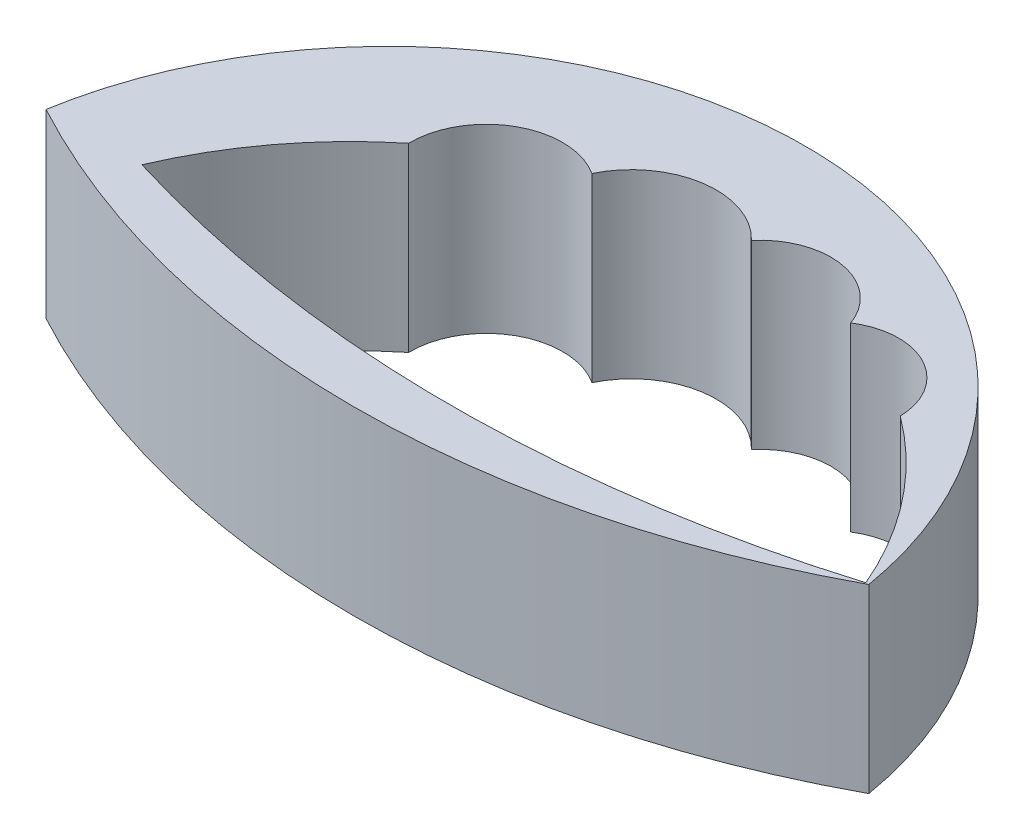
ISO-10303-21;
HEADER;
FILE_DESCRIPTION(('STEP AP214'),'2;1');
FILE_NAME('part.step','',(''),(''),'','','');
FILE_SCHEMA(('AUTOMOTIVE_DESIGN { 1 0 10303 214 1 1 1 1 }'));
ENDSEC;
DATA;
#1=APPLICATION_CONTEXT('core data for automotive mechanical design processes');
#2=APPLICATION_PROTOCOL_DEFINITION('international standard','automotive_design',2000,#1);
#3=PRODUCT_CONTEXT('',#1,'mechanical');
#4=PRODUCT('Part','Part','',(#3));
#5=PRODUCT_RELATED_PRODUCT_CATEGORY('part','',(#4));
#6=PRODUCT_DEFINITION_FORMATION('','',#4);
#7=PRODUCT_DEFINITION_CONTEXT('part definition',#1,'design');
#8=PRODUCT_DEFINITION('design','',#6,#7);
#9=PRODUCT_DEFINITION_SHAPE('','',#8);
#10=(LENGTH_UNIT() NAMED_UNIT(*) SI_UNIT(.MILLI.,.METRE.));
#11=(NAMED_UNIT(*) PLANE_ANGLE_UNIT() SI_UNIT($,.RADIAN.));
#12=(NAMED_UNIT(*) SI_UNIT($,.STERADIAN.) SOLID_ANGLE_UNIT());
#13=UNCERTAINTY_MEASURE_WITH_UNIT(LENGTH_MEASURE(1.E-05),#10,'distance_accuracy_value','');
#14=(GEOMETRIC_REPRESENTATION_CONTEXT(3) GLOBAL_UNCERTAINTY_ASSIGNED_CONTEXT((#13)) GLOBAL_UNIT_ASSIGNED_CONTEXT((#10,
#11,#12)) REPRESENTATION_CONTEXT('',''));
#15=CARTESIAN_POINT('',(0.,0.,0.));
#16=DIRECTION('',(0.,0.,1.));
#17=DIRECTION('',(1.,0.,0.));
#18=AXIS2_PLACEMENT_3D('',#15,#16,#17);
#19=CARTESIAN_POINT('',(27.9373271008039,12.3,-51.9168665411247));
#20=DIRECTION('',(0.,-1.,0.));
#21=DIRECTION('',(0.,0.,-1.));
#22=AXIS2_PLACEMENT_3D('',#19,#20,#21);
#23=CYLINDRICAL_SURFACE('',#22,58.9563845311622);
#24=CARTESIAN_POINT('',(27.9373271008039,0.,-51.9168665411247));
#25=DIRECTION('',(0.,1.,0.));
#26=DIRECTION('',(0.,0.,1.));
#27=AXIS2_PLACEMENT_3D('',#24,#25,#26);
#28=CIRCLE('',#27,58.9563845311622);
#29=CARTESIAN_POINT('',(0.,0.,0.));
#30=VERTEX_POINT('',#29);
#31=CARTESIAN_POINT('',(55.8746542016078,0.,0.));
#32=VERTEX_POINT('',#31);
#33=EDGE_CURVE('E178',#30,#32,#28,.T.);
#34=ORIENTED_EDGE('',*,*,#33,.T.);
#35=DIRECTION('',(0.,-1.,0.));
#36=VECTOR('',#35,1.);
#37=CARTESIAN_POINT('',(55.8746542016078,12.3,0.));
#38=LINE('',#37,#36);
#39=CARTESIAN_POINT('',(55.8746542016078,12.3,0.));
#40=VERTEX_POINT('',#39);
#41=EDGE_CURVE('E11',#40,#32,#38,.T.);
#42=ORIENTED_EDGE('',*,*,#41,.F.);
#43=CARTESIAN_POINT('',(27.9373271008039,12.3,-51.9168665411247));
#44=DIRECTION('',(0.,1.,0.));
#45=DIRECTION('',(0.,0.,1.));
#46=AXIS2_PLACEMENT_3D('',#43,#44,#45);
#47=CIRCLE('',#46,58.9563845311622);
#48=CARTESIAN_POINT('',(0.,12.3,0.));
#49=VERTEX_POINT('',#48);
#50=EDGE_CURVE('E193',#49,#40,#47,.T.);
#51=ORIENTED_EDGE('',*,*,#50,.F.);
#52=DIRECTION('',(0.,-1.,0.));
#53=VECTOR('',#52,1.);
#54=CARTESIAN_POINT('',(0.,12.3,0.));
#55=LINE('',#54,#53);
#56=EDGE_CURVE('E48',#49,#30,#55,.T.);
#57=ORIENTED_EDGE('',*,*,#56,.T.);
#58=EDGE_LOOP('',(#34,#42,#51,#57));
#59=FACE_BOUND('',#58,.T.);
#60=ADVANCED_FACE('F40',(#59),#23,.T.);
#61=CARTESIAN_POINT('',(27.9373271008039,12.3,4.70746125264342));
#62=DIRECTION('',(0.,-1.,0.));
#63=DIRECTION('',(0.,0.,-1.));
#64=AXIS2_PLACEMENT_3D('',#61,#62,#63);
#65=CYLINDRICAL_SURFACE('',#64,28.3311566474518);
#66=CARTESIAN_POINT('',(27.9373271008039,0.,4.70746125264342));
#67=DIRECTION('',(0.,1.,0.));
#68=DIRECTION('',(0.,0.,-1.));
#69=AXIS2_PLACEMENT_3D('',#66,#67,#68);
#70=CIRCLE('',#69,28.3311566474518);
#71=EDGE_CURVE('E198',#32,#30,#70,.T.);
#72=ORIENTED_EDGE('',*,*,#71,.T.);
#73=ORIENTED_EDGE('',*,*,#56,.F.);
#74=CARTESIAN_POINT('',(27.9373271008039,12.3,4.70746125264342));
#75=DIRECTION('',(0.,1.,0.));
#76=DIRECTION('',(0.,0.,-1.));
#77=AXIS2_PLACEMENT_3D('',#74,#75,#76);
#78=CIRCLE('',#77,28.3311566474518);
#79=EDGE_CURVE('E197',#40,#49,#78,.T.);
#80=ORIENTED_EDGE('',*,*,#79,.F.);
#81=ORIENTED_EDGE('',*,*,#41,.T.);
#82=EDGE_LOOP('',(#72,#73,#80,#81));
#83=FACE_BOUND('',#82,.T.);
#84=ADVANCED_FACE('F213',(#83),#65,.T.);
#85=CARTESIAN_POINT('',(27.9373271008039,12.3,-23.6047026442406));
#86=DIRECTION('',(0.,1.,0.));
#87=DIRECTION('',(0.,0.,1.));
#88=AXIS2_PLACEMENT_3D('',#85,#86,#87);
#89=PLANE('',#88);
#90=CARTESIAN_POINT('',(31.0914909611745,12.3,-80.735267567156));
#91=DIRECTION('',(0.,1.,0.));
#92=DIRECTION('',(0.,0.,1.));
#93=AXIS2_PLACEMENT_3D('',#90,#91,#92);
#94=CIRCLE('',#93,84.3936748552989);
#95=CARTESIAN_POINT('',(6.51286352916273,12.3,0.));
#96=VERTEX_POINT('',#95);
#97=CARTESIAN_POINT('',(55.6701183931864,12.3,0.));
#98=VERTEX_POINT('',#97);
#99=EDGE_CURVE('E55',#96,#98,#94,.T.);
#100=ORIENTED_EDGE('',*,*,#99,.F.);
#101=CARTESIAN_POINT('',(31.0914909611746,12.3,10.4574908849649));
#102=DIRECTION('',(0.,1.,0.));
#103=DIRECTION('',(0.,0.,-1.));
#104=AXIS2_PLACEMENT_3D('',#101,#102,#103);
#105=CIRCLE('',#104,26.7108225640988);
#106=CARTESIAN_POINT('',(14.3046767115117,12.3,-10.3192006081021));
#107=VERTEX_POINT('',#106);
#108=EDGE_CURVE('E133',#107,#96,#105,.T.);
#109=ORIENTED_EDGE('',*,*,#108,.F.);
#110=CARTESIAN_POINT('',(19.4880155231299,12.3,-10.4147835507958));
#111=DIRECTION('',(0.,1.,0.));
#112=DIRECTION('',(0.,0.,-1.));
#113=AXIS2_PLACEMENT_3D('',#110,#111,#112);
#114=CIRCLE('',#113,5.18422003149576);
#115=CARTESIAN_POINT('',(22.3050641723076,12.3,-14.7668375765551));
#116=VERTEX_POINT('',#115);
#117=EDGE_CURVE('E137',#116,#107,#114,.T.);
#118=ORIENTED_EDGE('',*,*,#117,.F.);
#119=CARTESIAN_POINT('',(27.4946298311046,12.3,-12.2623713788484));
#120=DIRECTION('',(0.,1.,0.));
#121=DIRECTION('',(0.,0.,-1.));
#122=AXIS2_PLACEMENT_3D('',#119,#120,#121);
#123=CIRCLE('',#122,5.76228623572453);
#124=CARTESIAN_POINT('',(31.6568289778504,12.3,-16.2473482828277));
#125=VERTEX_POINT('',#124);
#126=EDGE_CURVE('E168',#125,#116,#123,.T.);
#127=ORIENTED_EDGE('',*,*,#126,.F.);
#128=CARTESIAN_POINT('',(35.3424324552261,12.3,-13.1474497884964));
#129=DIRECTION('',(0.,1.,0.));
#130=DIRECTION('',(0.,0.,-1.));
#131=AXIS2_PLACEMENT_3D('',#128,#129,#130);
#132=CIRCLE('',#131,4.81591566242607);
#133=CARTESIAN_POINT('',(39.8779177500415,12.3,-14.7668375765551));
#134=VERTEX_POINT('',#133);
#135=EDGE_CURVE('E164',#134,#125,#132,.T.);
#136=ORIENTED_EDGE('',*,*,#135,.F.);
#137=CARTESIAN_POINT('',(42.3925829010144,12.3,-10.860276725775));
#138=DIRECTION('',(0.,1.,0.));
#139=DIRECTION('',(0.,0.,-1.));
#140=AXIS2_PLACEMENT_3D('',#137,#138,#139);
#141=CIRCLE('',#140,4.64594000201956);
#142=CARTESIAN_POINT('',(47.0371907899642,12.3,-10.9715244685437));
#143=VERTEX_POINT('',#142);
#144=EDGE_CURVE('E160',#143,#134,#141,.T.);
#145=ORIENTED_EDGE('',*,*,#144,.F.);
#146=CARTESIAN_POINT('',(31.0914909611746,12.3,10.4574908849649));
#147=DIRECTION('',(0.,1.,0.));
#148=DIRECTION('',(0.,0.,-1.));
#149=AXIS2_PLACEMENT_3D('',#146,#147,#148);
#150=CIRCLE('',#149,26.7108225640988);
#151=EDGE_CURVE('E157',#98,#143,#150,.T.);
#152=ORIENTED_EDGE('',*,*,#151,.F.);
#153=EDGE_LOOP('',(#100,#109,#118,#127,#136,#145,#152));
#154=FACE_BOUND('',#153,.T.);
#155=ORIENTED_EDGE('',*,*,#50,.T.);
#156=ORIENTED_EDGE('',*,*,#79,.T.);
#157=EDGE_LOOP('',(#155,#156));
#158=FACE_BOUND('',#157,.T.);
#159=ADVANCED_FACE('F215',(#154,#158),#89,.T.);
#160=CARTESIAN_POINT('',(27.9373271008039,0.,-23.6047026442406));
#161=DIRECTION('',(0.,1.,0.));
#162=DIRECTION('',(0.,0.,1.));
#163=AXIS2_PLACEMENT_3D('',#160,#161,#162);
#164=PLANE('',#163);
#165=CARTESIAN_POINT('',(31.0914909611746,0.,10.4574908849649));
#166=DIRECTION('',(0.,1.,0.));
#167=DIRECTION('',(0.,0.,-1.));
#168=AXIS2_PLACEMENT_3D('',#165,#166,#167);
#169=CIRCLE('',#168,26.7108225640988);
#170=CARTESIAN_POINT('',(14.3046767115117,0.,-10.3192006081021));
#171=VERTEX_POINT('',#170);
#172=CARTESIAN_POINT('',(6.51286352916273,0.,0.));
#173=VERTEX_POINT('',#172);
#174=EDGE_CURVE('E120',#171,#173,#169,.T.);
#175=ORIENTED_EDGE('',*,*,#174,.T.);
#176=CARTESIAN_POINT('',(31.0914909611745,0.,-80.735267567156));
#177=DIRECTION('',(0.,1.,0.));
#178=DIRECTION('',(0.,0.,1.));
#179=AXIS2_PLACEMENT_3D('',#176,#177,#178);
#180=CIRCLE('',#179,84.3936748552989);
#181=CARTESIAN_POINT('',(55.6701183931864,0.,0.));
#182=VERTEX_POINT('',#181);
#183=EDGE_CURVE('E113',#173,#182,#180,.T.);
#184=ORIENTED_EDGE('',*,*,#183,.T.);
#185=CARTESIAN_POINT('',(31.0914909611746,0.,10.4574908849649));
#186=DIRECTION('',(0.,1.,0.));
#187=DIRECTION('',(0.,0.,-1.));
#188=AXIS2_PLACEMENT_3D('',#185,#186,#187);
#189=CIRCLE('',#188,26.7108225640988);
#190=CARTESIAN_POINT('',(47.0371907899642,0.,-10.9715244685437));
#191=VERTEX_POINT('',#190);
#192=EDGE_CURVE('E123',#182,#191,#189,.T.);
#193=ORIENTED_EDGE('',*,*,#192,.T.);
#194=CARTESIAN_POINT('',(42.3925829010144,0.,-10.860276725775));
#195=DIRECTION('',(0.,1.,0.));
#196=DIRECTION('',(0.,0.,-1.));
#197=AXIS2_PLACEMENT_3D('',#194,#195,#196);
#198=CIRCLE('',#197,4.64594000201956);
#199=CARTESIAN_POINT('',(39.8779177500415,0.,-14.7668375765551));
#200=VERTEX_POINT('',#199);
#201=EDGE_CURVE('E63',#191,#200,#198,.T.);
#202=ORIENTED_EDGE('',*,*,#201,.T.);
#203=CARTESIAN_POINT('',(35.3424324552261,0.,-13.1474497884964));
#204=DIRECTION('',(0.,1.,0.));
#205=DIRECTION('',(0.,0.,-1.));
#206=AXIS2_PLACEMENT_3D('',#203,#204,#205);
#207=CIRCLE('',#206,4.81591566242607);
#208=CARTESIAN_POINT('',(31.6568289778504,0.,-16.2473482828277));
#209=VERTEX_POINT('',#208);
#210=EDGE_CURVE('E142',#200,#209,#207,.T.);
#211=ORIENTED_EDGE('',*,*,#210,.T.);
#212=CARTESIAN_POINT('',(27.4946298311046,0.,-12.2623713788484));
#213=DIRECTION('',(0.,1.,0.));
#214=DIRECTION('',(0.,0.,-1.));
#215=AXIS2_PLACEMENT_3D('',#212,#213,#214);
#216=CIRCLE('',#215,5.76228623572453);
#217=CARTESIAN_POINT('',(22.3050641723076,0.,-14.7668375765551));
#218=VERTEX_POINT('',#217);
#219=EDGE_CURVE('E146',#209,#218,#216,.T.);
#220=ORIENTED_EDGE('',*,*,#219,.T.);
#221=CARTESIAN_POINT('',(19.4880155231299,0.,-10.4147835507958));
#222=DIRECTION('',(0.,1.,0.));
#223=DIRECTION('',(0.,0.,-1.));
#224=AXIS2_PLACEMENT_3D('',#221,#222,#223);
#225=CIRCLE('',#224,5.18422003149576);
#226=EDGE_CURVE('E150',#218,#171,#225,.T.);
#227=ORIENTED_EDGE('',*,*,#226,.T.);
#228=EDGE_LOOP('',(#175,#184,#193,#202,#211,#220,#227));
#229=FACE_BOUND('',#228,.T.);
#230=ORIENTED_EDGE('',*,*,#33,.F.);
#231=ORIENTED_EDGE('',*,*,#71,.F.);
#232=EDGE_LOOP('',(#230,#231));
#233=FACE_BOUND('',#232,.T.);
#234=ADVANCED_FACE('F128',(#229,#233),#164,.F.);
#235=CARTESIAN_POINT('',(31.0914909611745,0.,-80.735267567156));
#236=DIRECTION('',(0.,1.,0.));
#237=DIRECTION('',(0.,0.,1.));
#238=AXIS2_PLACEMENT_3D('',#235,#236,#237);
#239=CYLINDRICAL_SURFACE('',#238,84.3936748552989);
#240=ORIENTED_EDGE('',*,*,#99,.T.);
#241=DIRECTION('',(0.,1.,0.));
#242=VECTOR('',#241,1.);
#243=CARTESIAN_POINT('',(55.6701183931864,0.,0.));
#244=LINE('',#243,#242);
#245=EDGE_CURVE('E109',#182,#98,#244,.T.);
#246=ORIENTED_EDGE('',*,*,#245,.F.);
#247=ORIENTED_EDGE('',*,*,#183,.F.);
#248=DIRECTION('',(0.,1.,0.));
#249=VECTOR('',#248,1.);
#250=CARTESIAN_POINT('',(6.51286352916273,0.,0.));
#251=LINE('',#250,#249);
#252=EDGE_CURVE('E175',#173,#96,#251,.T.);
#253=ORIENTED_EDGE('',*,*,#252,.T.);
#254=EDGE_LOOP('',(#240,#246,#247,#253));
#255=FACE_BOUND('',#254,.T.);
#256=ADVANCED_FACE('F111',(#255),#239,.F.);
#257=CARTESIAN_POINT('',(31.0914909611746,0.,10.4574908849649));
#258=DIRECTION('',(0.,1.,0.));
#259=DIRECTION('',(0.,0.,1.));
#260=AXIS2_PLACEMENT_3D('',#257,#258,#259);
#261=CYLINDRICAL_SURFACE('',#260,26.7108225640988);
#262=ORIENTED_EDGE('',*,*,#108,.T.);
#263=ORIENTED_EDGE('',*,*,#252,.F.);
#264=ORIENTED_EDGE('',*,*,#174,.F.);
#265=DIRECTION('',(0.,1.,0.));
#266=VECTOR('',#265,1.);
#267=CARTESIAN_POINT('',(14.3046767115117,0.,-10.3192006081021));
#268=LINE('',#267,#266);
#269=EDGE_CURVE('E179',#171,#107,#268,.T.);
#270=ORIENTED_EDGE('',*,*,#269,.T.);
#271=EDGE_LOOP('',(#262,#263,#264,#270));
#272=FACE_BOUND('',#271,.T.);
#273=ADVANCED_FACE('F251',(#272),#261,.F.);
#274=CARTESIAN_POINT('',(19.4880155231299,0.,-10.4147835507958));
#275=DIRECTION('',(0.,1.,0.));
#276=DIRECTION('',(0.,0.,1.));
#277=AXIS2_PLACEMENT_3D('',#274,#275,#276);
#278=CYLINDRICAL_SURFACE('',#277,5.18422003149576);
#279=ORIENTED_EDGE('',*,*,#117,.T.);
#280=ORIENTED_EDGE('',*,*,#269,.F.);
#281=ORIENTED_EDGE('',*,*,#226,.F.);
#282=DIRECTION('',(0.,1.,0.));
#283=VECTOR('',#282,1.);
#284=CARTESIAN_POINT('',(22.3050641723076,0.,-14.7668375765551));
#285=LINE('',#284,#283);
#286=EDGE_CURVE('E182',#218,#116,#285,.T.);
#287=ORIENTED_EDGE('',*,*,#286,.T.);
#288=EDGE_LOOP('',(#279,#280,#281,#287));
#289=FACE_BOUND('',#288,.T.);
#290=ADVANCED_FACE('F259',(#289),#278,.F.);
#291=CARTESIAN_POINT('',(27.4946298311046,0.,-12.2623713788484));
#292=DIRECTION('',(0.,1.,0.));
#293=DIRECTION('',(0.,0.,1.));
#294=AXIS2_PLACEMENT_3D('',#291,#292,#293);
#295=CYLINDRICAL_SURFACE('',#294,5.76228623572453);
#296=ORIENTED_EDGE('',*,*,#126,.T.);
#297=ORIENTED_EDGE('',*,*,#286,.F.);
#298=ORIENTED_EDGE('',*,*,#219,.F.);
#299=DIRECTION('',(0.,1.,0.));
#300=VECTOR('',#299,1.);
#301=CARTESIAN_POINT('',(31.6568289778504,0.,-16.2473482828277));
#302=LINE('',#301,#300);
#303=EDGE_CURVE('E185',#209,#125,#302,.T.);
#304=ORIENTED_EDGE('',*,*,#303,.T.);
#305=EDGE_LOOP('',(#296,#297,#298,#304));
#306=FACE_BOUND('',#305,.T.);
#307=ADVANCED_FACE('F269',(#306),#295,.F.);
#308=CARTESIAN_POINT('',(35.3424324552261,0.,-13.1474497884964));
#309=DIRECTION('',(0.,1.,0.));
#310=DIRECTION('',(0.,0.,1.));
#311=AXIS2_PLACEMENT_3D('',#308,#309,#310);
#312=CYLINDRICAL_SURFACE('',#311,4.81591566242607);
#313=ORIENTED_EDGE('',*,*,#135,.T.);
#314=ORIENTED_EDGE('',*,*,#303,.F.);
#315=ORIENTED_EDGE('',*,*,#210,.F.);
#316=DIRECTION('',(0.,1.,0.));
#317=VECTOR('',#316,1.);
#318=CARTESIAN_POINT('',(39.8779177500415,0.,-14.7668375765551));
#319=LINE('',#318,#317);
#320=EDGE_CURVE('E188',#200,#134,#319,.T.);
#321=ORIENTED_EDGE('',*,*,#320,.T.);
#322=EDGE_LOOP('',(#313,#314,#315,#321));
#323=FACE_BOUND('',#322,.T.);
#324=ADVANCED_FACE('F279',(#323),#312,.F.);
#325=CARTESIAN_POINT('',(42.3925829010144,0.,-10.860276725775));
#326=DIRECTION('',(0.,1.,0.));
#327=DIRECTION('',(0.,0.,1.));
#328=AXIS2_PLACEMENT_3D('',#325,#326,#327);
#329=CYLINDRICAL_SURFACE('',#328,4.64594000201956);
#330=ORIENTED_EDGE('',*,*,#144,.T.);
#331=ORIENTED_EDGE('',*,*,#320,.F.);
#332=ORIENTED_EDGE('',*,*,#201,.F.);
#333=DIRECTION('',(0.,1.,0.));
#334=VECTOR('',#333,1.);
#335=CARTESIAN_POINT('',(47.0371907899642,0.,-10.9715244685437));
#336=LINE('',#335,#334);
#337=EDGE_CURVE('E119',#191,#143,#336,.T.);
#338=ORIENTED_EDGE('',*,*,#337,.T.);
#339=EDGE_LOOP('',(#330,#331,#332,#338));
#340=FACE_BOUND('',#339,.T.);
#341=ADVANCED_FACE('F289',(#340),#329,.F.);
#342=CARTESIAN_POINT('',(31.0914909611746,0.,10.4574908849649));
#343=DIRECTION('',(0.,1.,0.));
#344=DIRECTION('',(0.,0.,1.));
#345=AXIS2_PLACEMENT_3D('',#342,#343,#344);
#346=CYLINDRICAL_SURFACE('',#345,26.7108225640988);
#347=ORIENTED_EDGE('',*,*,#151,.T.);
#348=ORIENTED_EDGE('',*,*,#337,.F.);
#349=ORIENTED_EDGE('',*,*,#192,.F.);
#350=ORIENTED_EDGE('',*,*,#245,.T.);
#351=EDGE_LOOP('',(#347,#348,#349,#350));
#352=FACE_BOUND('',#351,.T.);
#353=ADVANCED_FACE('F124',(#352),#346,.F.);
#354=CLOSED_SHELL('',(#60,#84,#159,#234,#256,#273,#290,#307,#324,#341,#353));
#355=MANIFOLD_SOLID_BREP('B2',#354);
#356=ADVANCED_BREP_SHAPE_REPRESENTATION('',(#18,#355),#14);
#357=SHAPE_DEFINITION_REPRESENTATION(#9,#356);
ENDSEC;
END-ISO-10303-21;
